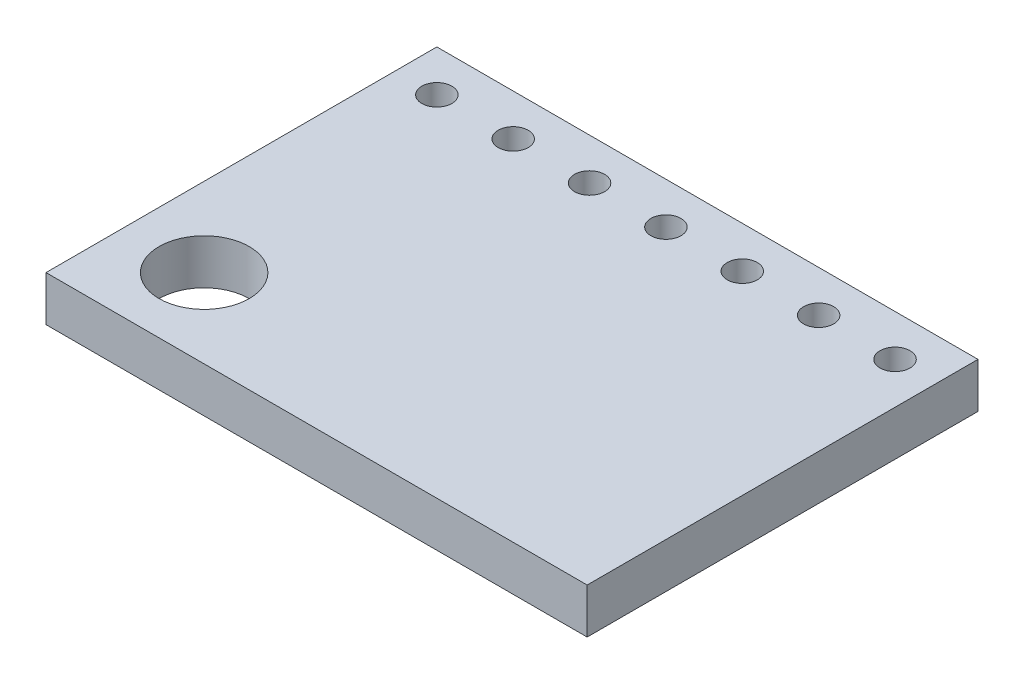
ISO-10303-21;
HEADER;
FILE_DESCRIPTION(('STEP AP214'),'2;1');
FILE_NAME('part.step','',(''),(''),'','','');
FILE_SCHEMA(('AUTOMOTIVE_DESIGN { 1 0 10303 214 1 1 1 1 }'));
ENDSEC;
DATA;
#1=APPLICATION_CONTEXT('core data for automotive mechanical design processes');
#2=APPLICATION_PROTOCOL_DEFINITION('international standard','automotive_design',2000,#1);
#3=PRODUCT_CONTEXT('',#1,'mechanical');
#4=PRODUCT('Part','Part','',(#3));
#5=PRODUCT_RELATED_PRODUCT_CATEGORY('part','',(#4));
#6=PRODUCT_DEFINITION_FORMATION('','',#4);
#7=PRODUCT_DEFINITION_CONTEXT('part definition',#1,'design');
#8=PRODUCT_DEFINITION('design','',#6,#7);
#9=PRODUCT_DEFINITION_SHAPE('','',#8);
#10=(LENGTH_UNIT() NAMED_UNIT(*) SI_UNIT(.MILLI.,.METRE.));
#11=(NAMED_UNIT(*) PLANE_ANGLE_UNIT() SI_UNIT($,.RADIAN.));
#12=(NAMED_UNIT(*) SI_UNIT($,.STERADIAN.) SOLID_ANGLE_UNIT());
#13=UNCERTAINTY_MEASURE_WITH_UNIT(LENGTH_MEASURE(1.E-05),#10,'distance_accuracy_value','');
#14=(GEOMETRIC_REPRESENTATION_CONTEXT(3) GLOBAL_UNCERTAINTY_ASSIGNED_CONTEXT((#13)) GLOBAL_UNIT_ASSIGNED_CONTEXT((#10,
#11,#12)) REPRESENTATION_CONTEXT('',''));
#15=CARTESIAN_POINT('',(0.,0.,0.));
#16=DIRECTION('',(0.,0.,1.));
#17=DIRECTION('',(1.,0.,0.));
#18=AXIS2_PLACEMENT_3D('',#15,#16,#17);
#19=CARTESIAN_POINT('',(0.,-1.5,0.));
#20=DIRECTION('',(-1.,0.,0.));
#21=DIRECTION('',(0.,0.,1.));
#22=AXIS2_PLACEMENT_3D('',#19,#20,#21);
#23=PLANE('',#22);
#24=DIRECTION('',(0.,0.,1.));
#25=VECTOR('',#24,1.);
#26=CARTESIAN_POINT('',(0.,0.,0.));
#27=LINE('',#26,#25);
#28=CARTESIAN_POINT('',(0.,0.,0.));
#29=VERTEX_POINT('',#28);
#30=CARTESIAN_POINT('',(0.,0.,13.));
#31=VERTEX_POINT('',#30);
#32=EDGE_CURVE('E101',#29,#31,#27,.T.);
#33=ORIENTED_EDGE('',*,*,#32,.F.);
#34=DIRECTION('',(0.,1.,0.));
#35=VECTOR('',#34,1.);
#36=CARTESIAN_POINT('',(0.,-1.5,0.));
#37=LINE('',#36,#35);
#38=CARTESIAN_POINT('',(0.,-1.5,0.));
#39=VERTEX_POINT('',#38);
#40=EDGE_CURVE('E11',#39,#29,#37,.T.);
#41=ORIENTED_EDGE('',*,*,#40,.F.);
#42=DIRECTION('',(0.,0.,1.));
#43=VECTOR('',#42,1.);
#44=CARTESIAN_POINT('',(0.,-1.5,0.));
#45=LINE('',#44,#43);
#46=CARTESIAN_POINT('',(0.,-1.5,13.));
#47=VERTEX_POINT('',#46);
#48=EDGE_CURVE('E94',#39,#47,#45,.T.);
#49=ORIENTED_EDGE('',*,*,#48,.T.);
#50=DIRECTION('',(0.,1.,0.));
#51=VECTOR('',#50,1.);
#52=CARTESIAN_POINT('',(0.,-1.5,13.));
#53=LINE('',#52,#51);
#54=EDGE_CURVE('E39',#47,#31,#53,.T.);
#55=ORIENTED_EDGE('',*,*,#54,.T.);
#56=EDGE_LOOP('',(#33,#41,#49,#55));
#57=FACE_BOUND('',#56,.T.);
#58=ADVANCED_FACE('F36',(#57),#23,.T.);
#59=CARTESIAN_POINT('',(0.,-1.5,0.));
#60=DIRECTION('',(0.,0.,-1.));
#61=DIRECTION('',(-1.,0.,0.));
#62=AXIS2_PLACEMENT_3D('',#59,#60,#61);
#63=PLANE('',#62);
#64=DIRECTION('',(-1.,0.,0.));
#65=VECTOR('',#64,1.);
#66=CARTESIAN_POINT('',(0.,0.,0.));
#67=LINE('',#66,#65);
#68=CARTESIAN_POINT('',(18.,0.,0.));
#69=VERTEX_POINT('',#68);
#70=EDGE_CURVE('E96',#69,#29,#67,.T.);
#71=ORIENTED_EDGE('',*,*,#70,.F.);
#72=DIRECTION('',(0.,1.,0.));
#73=VECTOR('',#72,1.);
#74=CARTESIAN_POINT('',(18.,-1.5,0.));
#75=LINE('',#74,#73);
#76=CARTESIAN_POINT('',(18.,-1.5,0.));
#77=VERTEX_POINT('',#76);
#78=EDGE_CURVE('E45',#77,#69,#75,.T.);
#79=ORIENTED_EDGE('',*,*,#78,.F.);
#80=DIRECTION('',(-1.,0.,0.));
#81=VECTOR('',#80,1.);
#82=CARTESIAN_POINT('',(0.,-1.5,0.));
#83=LINE('',#82,#81);
#84=EDGE_CURVE('E91',#77,#39,#83,.T.);
#85=ORIENTED_EDGE('',*,*,#84,.T.);
#86=ORIENTED_EDGE('',*,*,#40,.T.);
#87=EDGE_LOOP('',(#71,#79,#85,#86));
#88=FACE_BOUND('',#87,.T.);
#89=ADVANCED_FACE('F112',(#88),#63,.T.);
#90=CARTESIAN_POINT('',(18.,-1.5,0.));
#91=DIRECTION('',(1.,0.,0.));
#92=DIRECTION('',(0.,0.,-1.));
#93=AXIS2_PLACEMENT_3D('',#90,#91,#92);
#94=PLANE('',#93);
#95=DIRECTION('',(0.,0.,-1.));
#96=VECTOR('',#95,1.);
#97=CARTESIAN_POINT('',(18.,0.,0.));
#98=LINE('',#97,#96);
#99=CARTESIAN_POINT('',(18.,0.,13.));
#100=VERTEX_POINT('',#99);
#101=EDGE_CURVE('E86',#100,#69,#98,.T.);
#102=ORIENTED_EDGE('',*,*,#101,.F.);
#103=DIRECTION('',(0.,1.,0.));
#104=VECTOR('',#103,1.);
#105=CARTESIAN_POINT('',(18.,-1.5,13.));
#106=LINE('',#105,#104);
#107=CARTESIAN_POINT('',(18.,-1.5,13.));
#108=VERTEX_POINT('',#107);
#109=EDGE_CURVE('E81',#108,#100,#106,.T.);
#110=ORIENTED_EDGE('',*,*,#109,.F.);
#111=DIRECTION('',(0.,0.,-1.));
#112=VECTOR('',#111,1.);
#113=CARTESIAN_POINT('',(18.,-1.5,0.));
#114=LINE('',#113,#112);
#115=EDGE_CURVE('E84',#108,#77,#114,.T.);
#116=ORIENTED_EDGE('',*,*,#115,.T.);
#117=ORIENTED_EDGE('',*,*,#78,.T.);
#118=EDGE_LOOP('',(#102,#110,#116,#117));
#119=FACE_BOUND('',#118,.T.);
#120=ADVANCED_FACE('F83',(#119),#94,.T.);
#121=CARTESIAN_POINT('',(0.,-1.5,13.));
#122=DIRECTION('',(0.,0.,1.));
#123=DIRECTION('',(1.,0.,0.));
#124=AXIS2_PLACEMENT_3D('',#121,#122,#123);
#125=PLANE('',#124);
#126=DIRECTION('',(1.,0.,0.));
#127=VECTOR('',#126,1.);
#128=CARTESIAN_POINT('',(0.,0.,13.));
#129=LINE('',#128,#127);
#130=EDGE_CURVE('E104',#31,#100,#129,.T.);
#131=ORIENTED_EDGE('',*,*,#130,.F.);
#132=ORIENTED_EDGE('',*,*,#54,.F.);
#133=DIRECTION('',(1.,0.,0.));
#134=VECTOR('',#133,1.);
#135=CARTESIAN_POINT('',(0.,-1.5,13.));
#136=LINE('',#135,#134);
#137=EDGE_CURVE('E90',#47,#108,#136,.T.);
#138=ORIENTED_EDGE('',*,*,#137,.T.);
#139=ORIENTED_EDGE('',*,*,#109,.T.);
#140=EDGE_LOOP('',(#131,#132,#138,#139));
#141=FACE_BOUND('',#140,.T.);
#142=ADVANCED_FACE('F93',(#141),#125,.T.);
#143=CARTESIAN_POINT('',(0.,-1.5,0.));
#144=DIRECTION('',(0.,1.,0.));
#145=DIRECTION('',(0.,0.,1.));
#146=AXIS2_PLACEMENT_3D('',#143,#144,#145);
#147=PLANE('',#146);
#148=CARTESIAN_POINT('',(16.62,-1.5,1.38));
#149=DIRECTION('',(0.,1.,0.));
#150=DIRECTION('',(0.,0.,1.));
#151=AXIS2_PLACEMENT_3D('',#148,#149,#150);
#152=CIRCLE('',#151,0.499999999999999);
#153=CARTESIAN_POINT('',(16.62,-1.5,1.88));
#154=VERTEX_POINT('',#153);
#155=EDGE_CURVE('E169',#154,#154,#152,.T.);
#156=ORIENTED_EDGE('',*,*,#155,.T.);
#157=EDGE_LOOP('',(#156));
#158=FACE_BOUND('',#157,.T.);
#159=CARTESIAN_POINT('',(14.08,-1.5,1.38));
#160=DIRECTION('',(0.,1.,0.));
#161=DIRECTION('',(0.,0.,1.));
#162=AXIS2_PLACEMENT_3D('',#159,#160,#161);
#163=CIRCLE('',#162,0.500000000000001);
#164=CARTESIAN_POINT('',(14.08,-1.5,1.88));
#165=VERTEX_POINT('',#164);
#166=EDGE_CURVE('E177',#165,#165,#163,.T.);
#167=ORIENTED_EDGE('',*,*,#166,.T.);
#168=EDGE_LOOP('',(#167));
#169=FACE_BOUND('',#168,.T.);
#170=CARTESIAN_POINT('',(11.54,-1.5,1.38));
#171=DIRECTION('',(0.,1.,0.));
#172=DIRECTION('',(0.,0.,1.));
#173=AXIS2_PLACEMENT_3D('',#170,#171,#172);
#174=CIRCLE('',#173,0.500000000000001);
#175=CARTESIAN_POINT('',(11.54,-1.5,1.88));
#176=VERTEX_POINT('',#175);
#177=EDGE_CURVE('E183',#176,#176,#174,.T.);
#178=ORIENTED_EDGE('',*,*,#177,.T.);
#179=EDGE_LOOP('',(#178));
#180=FACE_BOUND('',#179,.T.);
#181=CARTESIAN_POINT('',(9.,-1.5,1.38));
#182=DIRECTION('',(0.,1.,0.));
#183=DIRECTION('',(0.,0.,1.));
#184=AXIS2_PLACEMENT_3D('',#181,#182,#183);
#185=CIRCLE('',#184,0.500000000000001);
#186=CARTESIAN_POINT('',(9.,-1.5,1.88));
#187=VERTEX_POINT('',#186);
#188=EDGE_CURVE('E189',#187,#187,#185,.T.);
#189=ORIENTED_EDGE('',*,*,#188,.T.);
#190=EDGE_LOOP('',(#189));
#191=FACE_BOUND('',#190,.T.);
#192=CARTESIAN_POINT('',(6.46,-1.5,1.38));
#193=DIRECTION('',(0.,1.,0.));
#194=DIRECTION('',(0.,0.,1.));
#195=AXIS2_PLACEMENT_3D('',#192,#193,#194);
#196=CIRCLE('',#195,0.5);
#197=CARTESIAN_POINT('',(6.46,-1.5,1.88));
#198=VERTEX_POINT('',#197);
#199=EDGE_CURVE('E195',#198,#198,#196,.T.);
#200=ORIENTED_EDGE('',*,*,#199,.T.);
#201=EDGE_LOOP('',(#200));
#202=FACE_BOUND('',#201,.T.);
#203=CARTESIAN_POINT('',(3.92,-1.5,1.38));
#204=DIRECTION('',(0.,1.,0.));
#205=DIRECTION('',(0.,0.,1.));
#206=AXIS2_PLACEMENT_3D('',#203,#204,#205);
#207=CIRCLE('',#206,0.500000000000001);
#208=CARTESIAN_POINT('',(3.92,-1.5,1.88));
#209=VERTEX_POINT('',#208);
#210=EDGE_CURVE('E201',#209,#209,#207,.T.);
#211=ORIENTED_EDGE('',*,*,#210,.T.);
#212=EDGE_LOOP('',(#211));
#213=FACE_BOUND('',#212,.T.);
#214=CARTESIAN_POINT('',(2.63,-1.5,10.37));
#215=DIRECTION('',(0.,1.,0.));
#216=DIRECTION('',(0.,0.,1.));
#217=AXIS2_PLACEMENT_3D('',#214,#215,#216);
#218=CIRCLE('',#217,1.5);
#219=CARTESIAN_POINT('',(2.63,-1.5,11.87));
#220=VERTEX_POINT('',#219);
#221=EDGE_CURVE('E207',#220,#220,#218,.T.);
#222=ORIENTED_EDGE('',*,*,#221,.T.);
#223=EDGE_LOOP('',(#222));
#224=FACE_BOUND('',#223,.T.);
#225=CARTESIAN_POINT('',(1.38,-1.5,1.38));
#226=DIRECTION('',(0.,1.,0.));
#227=DIRECTION('',(0.,0.,1.));
#228=AXIS2_PLACEMENT_3D('',#225,#226,#227);
#229=CIRCLE('',#228,0.5);
#230=CARTESIAN_POINT('',(1.38,-1.5,1.88));
#231=VERTEX_POINT('',#230);
#232=EDGE_CURVE('E105',#231,#231,#229,.T.);
#233=ORIENTED_EDGE('',*,*,#232,.T.);
#234=EDGE_LOOP('',(#233));
#235=FACE_BOUND('',#234,.T.);
#236=ORIENTED_EDGE('',*,*,#48,.F.);
#237=ORIENTED_EDGE('',*,*,#84,.F.);
#238=ORIENTED_EDGE('',*,*,#115,.F.);
#239=ORIENTED_EDGE('',*,*,#137,.F.);
#240=EDGE_LOOP('',(#236,#237,#238,#239));
#241=FACE_BOUND('',#240,.T.);
#242=ADVANCED_FACE('F89',(#158,#169,#180,#191,#202,#213,#224,#235,#241),#147,.F.);
#243=CARTESIAN_POINT('',(0.,0.,0.));
#244=DIRECTION('',(0.,1.,0.));
#245=DIRECTION('',(0.,0.,1.));
#246=AXIS2_PLACEMENT_3D('',#243,#244,#245);
#247=PLANE('',#246);
#248=CARTESIAN_POINT('',(16.62,0.,1.38));
#249=DIRECTION('',(0.,1.,0.));
#250=DIRECTION('',(0.,0.,1.));
#251=AXIS2_PLACEMENT_3D('',#248,#249,#250);
#252=CIRCLE('',#251,0.499999999999999);
#253=CARTESIAN_POINT('',(16.62,0.,1.88));
#254=VERTEX_POINT('',#253);
#255=EDGE_CURVE('E172',#254,#254,#252,.T.);
#256=ORIENTED_EDGE('',*,*,#255,.F.);
#257=EDGE_LOOP('',(#256));
#258=FACE_BOUND('',#257,.T.);
#259=CARTESIAN_POINT('',(14.08,0.,1.38));
#260=DIRECTION('',(0.,1.,0.));
#261=DIRECTION('',(0.,0.,1.));
#262=AXIS2_PLACEMENT_3D('',#259,#260,#261);
#263=CIRCLE('',#262,0.500000000000001);
#264=CARTESIAN_POINT('',(14.08,0.,1.88));
#265=VERTEX_POINT('',#264);
#266=EDGE_CURVE('E174',#265,#265,#263,.T.);
#267=ORIENTED_EDGE('',*,*,#266,.F.);
#268=EDGE_LOOP('',(#267));
#269=FACE_BOUND('',#268,.T.);
#270=CARTESIAN_POINT('',(11.54,0.,1.38));
#271=DIRECTION('',(0.,1.,0.));
#272=DIRECTION('',(0.,0.,1.));
#273=AXIS2_PLACEMENT_3D('',#270,#271,#272);
#274=CIRCLE('',#273,0.500000000000001);
#275=CARTESIAN_POINT('',(11.54,0.,1.88));
#276=VERTEX_POINT('',#275);
#277=EDGE_CURVE('E180',#276,#276,#274,.T.);
#278=ORIENTED_EDGE('',*,*,#277,.F.);
#279=EDGE_LOOP('',(#278));
#280=FACE_BOUND('',#279,.T.);
#281=CARTESIAN_POINT('',(9.,0.,1.38));
#282=DIRECTION('',(0.,1.,0.));
#283=DIRECTION('',(0.,0.,1.));
#284=AXIS2_PLACEMENT_3D('',#281,#282,#283);
#285=CIRCLE('',#284,0.500000000000001);
#286=CARTESIAN_POINT('',(9.,0.,1.88));
#287=VERTEX_POINT('',#286);
#288=EDGE_CURVE('E186',#287,#287,#285,.T.);
#289=ORIENTED_EDGE('',*,*,#288,.F.);
#290=EDGE_LOOP('',(#289));
#291=FACE_BOUND('',#290,.T.);
#292=CARTESIAN_POINT('',(6.46,0.,1.38));
#293=DIRECTION('',(0.,1.,0.));
#294=DIRECTION('',(0.,0.,1.));
#295=AXIS2_PLACEMENT_3D('',#292,#293,#294);
#296=CIRCLE('',#295,0.5);
#297=CARTESIAN_POINT('',(6.46,0.,1.88));
#298=VERTEX_POINT('',#297);
#299=EDGE_CURVE('E192',#298,#298,#296,.T.);
#300=ORIENTED_EDGE('',*,*,#299,.F.);
#301=EDGE_LOOP('',(#300));
#302=FACE_BOUND('',#301,.T.);
#303=CARTESIAN_POINT('',(3.92,0.,1.38));
#304=DIRECTION('',(0.,1.,0.));
#305=DIRECTION('',(0.,0.,1.));
#306=AXIS2_PLACEMENT_3D('',#303,#304,#305);
#307=CIRCLE('',#306,0.500000000000001);
#308=CARTESIAN_POINT('',(3.92,0.,1.88));
#309=VERTEX_POINT('',#308);
#310=EDGE_CURVE('E198',#309,#309,#307,.T.);
#311=ORIENTED_EDGE('',*,*,#310,.F.);
#312=EDGE_LOOP('',(#311));
#313=FACE_BOUND('',#312,.T.);
#314=CARTESIAN_POINT('',(2.63,0.,10.37));
#315=DIRECTION('',(0.,1.,0.));
#316=DIRECTION('',(0.,0.,1.));
#317=AXIS2_PLACEMENT_3D('',#314,#315,#316);
#318=CIRCLE('',#317,1.5);
#319=CARTESIAN_POINT('',(2.63,0.,11.87));
#320=VERTEX_POINT('',#319);
#321=EDGE_CURVE('E204',#320,#320,#318,.T.);
#322=ORIENTED_EDGE('',*,*,#321,.F.);
#323=EDGE_LOOP('',(#322));
#324=FACE_BOUND('',#323,.T.);
#325=CARTESIAN_POINT('',(1.38,0.,1.38));
#326=DIRECTION('',(0.,1.,0.));
#327=DIRECTION('',(0.,0.,1.));
#328=AXIS2_PLACEMENT_3D('',#325,#326,#327);
#329=CIRCLE('',#328,0.5);
#330=CARTESIAN_POINT('',(1.38,0.,1.88));
#331=VERTEX_POINT('',#330);
#332=EDGE_CURVE('E210',#331,#331,#329,.T.);
#333=ORIENTED_EDGE('',*,*,#332,.F.);
#334=EDGE_LOOP('',(#333));
#335=FACE_BOUND('',#334,.T.);
#336=ORIENTED_EDGE('',*,*,#32,.T.);
#337=ORIENTED_EDGE('',*,*,#130,.T.);
#338=ORIENTED_EDGE('',*,*,#101,.T.);
#339=ORIENTED_EDGE('',*,*,#70,.T.);
#340=EDGE_LOOP('',(#336,#337,#338,#339));
#341=FACE_BOUND('',#340,.T.);
#342=ADVANCED_FACE('F111',(#258,#269,#280,#291,#302,#313,#324,#335,#341),#247,.T.);
#343=CARTESIAN_POINT('',(1.38,-1.5,1.38));
#344=DIRECTION('',(0.,1.,0.));
#345=DIRECTION('',(0.,0.,1.));
#346=AXIS2_PLACEMENT_3D('',#343,#344,#345);
#347=CYLINDRICAL_SURFACE('',#346,0.5);
#348=ORIENTED_EDGE('',*,*,#232,.F.);
#349=EDGE_LOOP('',(#348));
#350=FACE_BOUND('',#349,.T.);
#351=ORIENTED_EDGE('',*,*,#332,.T.);
#352=EDGE_LOOP('',(#351));
#353=FACE_BOUND('',#352,.T.);
#354=ADVANCED_FACE('F130',(#350,#353),#347,.F.);
#355=CARTESIAN_POINT('',(2.63,-1.5,10.37));
#356=DIRECTION('',(0.,1.,0.));
#357=DIRECTION('',(0.,0.,1.));
#358=AXIS2_PLACEMENT_3D('',#355,#356,#357);
#359=CYLINDRICAL_SURFACE('',#358,1.5);
#360=ORIENTED_EDGE('',*,*,#221,.F.);
#361=EDGE_LOOP('',(#360));
#362=FACE_BOUND('',#361,.T.);
#363=ORIENTED_EDGE('',*,*,#321,.T.);
#364=EDGE_LOOP('',(#363));
#365=FACE_BOUND('',#364,.T.);
#366=ADVANCED_FACE('F137',(#362,#365),#359,.F.);
#367=CARTESIAN_POINT('',(3.92,-1.5,1.38));
#368=DIRECTION('',(0.,1.,0.));
#369=DIRECTION('',(0.,0.,1.));
#370=AXIS2_PLACEMENT_3D('',#367,#368,#369);
#371=CYLINDRICAL_SURFACE('',#370,0.500000000000001);
#372=ORIENTED_EDGE('',*,*,#210,.F.);
#373=EDGE_LOOP('',(#372));
#374=FACE_BOUND('',#373,.T.);
#375=ORIENTED_EDGE('',*,*,#310,.T.);
#376=EDGE_LOOP('',(#375));
#377=FACE_BOUND('',#376,.T.);
#378=ADVANCED_FACE('F141',(#374,#377),#371,.F.);
#379=CARTESIAN_POINT('',(6.46,-1.5,1.38));
#380=DIRECTION('',(0.,1.,0.));
#381=DIRECTION('',(0.,0.,1.));
#382=AXIS2_PLACEMENT_3D('',#379,#380,#381);
#383=CYLINDRICAL_SURFACE('',#382,0.5);
#384=ORIENTED_EDGE('',*,*,#199,.F.);
#385=EDGE_LOOP('',(#384));
#386=FACE_BOUND('',#385,.T.);
#387=ORIENTED_EDGE('',*,*,#299,.T.);
#388=EDGE_LOOP('',(#387));
#389=FACE_BOUND('',#388,.T.);
#390=ADVANCED_FACE('F145',(#386,#389),#383,.F.);
#391=CARTESIAN_POINT('',(9.,-1.5,1.38));
#392=DIRECTION('',(0.,1.,0.));
#393=DIRECTION('',(0.,0.,1.));
#394=AXIS2_PLACEMENT_3D('',#391,#392,#393);
#395=CYLINDRICAL_SURFACE('',#394,0.500000000000001);
#396=ORIENTED_EDGE('',*,*,#188,.F.);
#397=EDGE_LOOP('',(#396));
#398=FACE_BOUND('',#397,.T.);
#399=ORIENTED_EDGE('',*,*,#288,.T.);
#400=EDGE_LOOP('',(#399));
#401=FACE_BOUND('',#400,.T.);
#402=ADVANCED_FACE('F149',(#398,#401),#395,.F.);
#403=CARTESIAN_POINT('',(11.54,-1.5,1.38));
#404=DIRECTION('',(0.,1.,0.));
#405=DIRECTION('',(0.,0.,1.));
#406=AXIS2_PLACEMENT_3D('',#403,#404,#405);
#407=CYLINDRICAL_SURFACE('',#406,0.500000000000001);
#408=ORIENTED_EDGE('',*,*,#177,.F.);
#409=EDGE_LOOP('',(#408));
#410=FACE_BOUND('',#409,.T.);
#411=ORIENTED_EDGE('',*,*,#277,.T.);
#412=EDGE_LOOP('',(#411));
#413=FACE_BOUND('',#412,.T.);
#414=ADVANCED_FACE('F153',(#410,#413),#407,.F.);
#415=CARTESIAN_POINT('',(14.08,-1.5,1.38));
#416=DIRECTION('',(0.,1.,0.));
#417=DIRECTION('',(0.,0.,1.));
#418=AXIS2_PLACEMENT_3D('',#415,#416,#417);
#419=CYLINDRICAL_SURFACE('',#418,0.500000000000001);
#420=ORIENTED_EDGE('',*,*,#166,.F.);
#421=EDGE_LOOP('',(#420));
#422=FACE_BOUND('',#421,.T.);
#423=ORIENTED_EDGE('',*,*,#266,.T.);
#424=EDGE_LOOP('',(#423));
#425=FACE_BOUND('',#424,.T.);
#426=ADVANCED_FACE('F157',(#422,#425),#419,.F.);
#427=CARTESIAN_POINT('',(16.62,-1.5,1.38));
#428=DIRECTION('',(0.,1.,0.));
#429=DIRECTION('',(0.,0.,1.));
#430=AXIS2_PLACEMENT_3D('',#427,#428,#429);
#431=CYLINDRICAL_SURFACE('',#430,0.499999999999999);
#432=ORIENTED_EDGE('',*,*,#155,.F.);
#433=EDGE_LOOP('',(#432));
#434=FACE_BOUND('',#433,.T.);
#435=ORIENTED_EDGE('',*,*,#255,.T.);
#436=EDGE_LOOP('',(#435));
#437=FACE_BOUND('',#436,.T.);
#438=ADVANCED_FACE('F161',(#434,#437),#431,.F.);
#439=CLOSED_SHELL('',(#58,#89,#120,#142,#242,#342,#354,#366,#378,#390,#402,#414,#426,#438));
#440=MANIFOLD_SOLID_BREP('B2',#439);
#441=ADVANCED_BREP_SHAPE_REPRESENTATION('',(#18,#440),#14);
#442=SHAPE_DEFINITION_REPRESENTATION(#9,#441);
ENDSEC;
END-ISO-10303-21;
